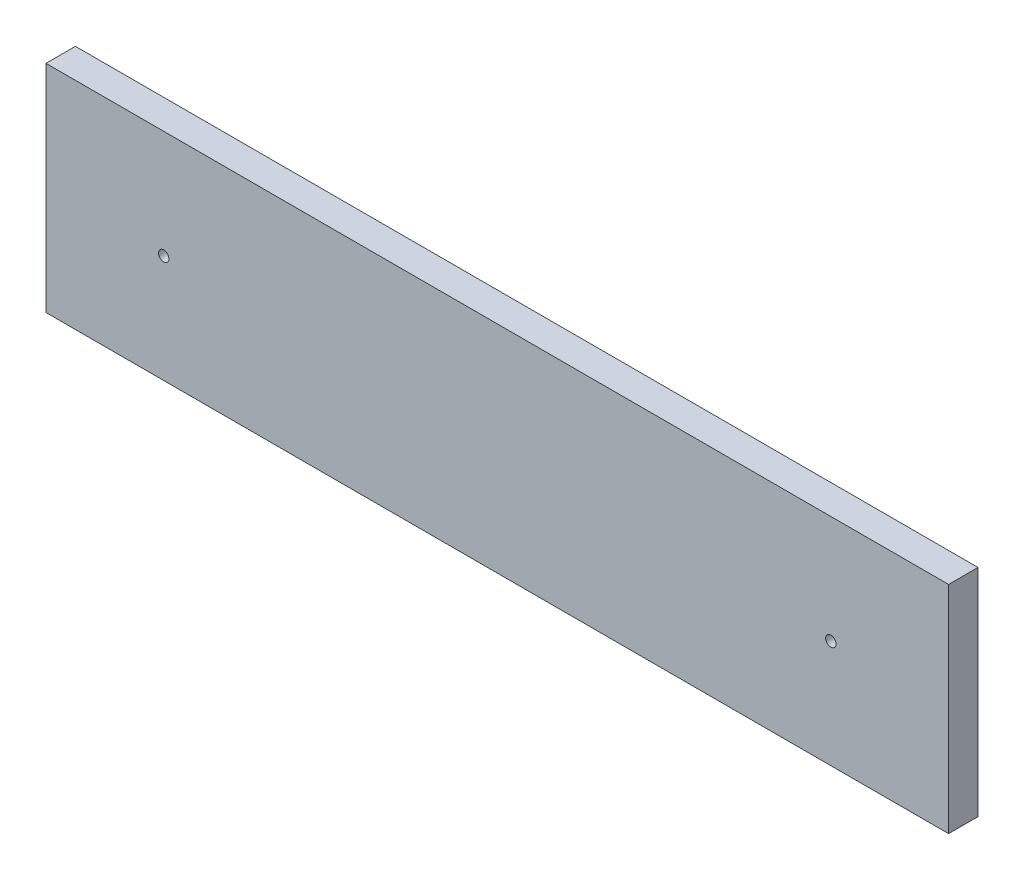
ISO-10303-21;
HEADER;
FILE_DESCRIPTION(('STEP AP214'),'2;1');
FILE_NAME('part.step','',(''),(''),'','','');
FILE_SCHEMA(('AUTOMOTIVE_DESIGN { 1 0 10303 214 1 1 1 1 }'));
ENDSEC;
DATA;
#1=APPLICATION_CONTEXT('core data for automotive mechanical design processes');
#2=APPLICATION_PROTOCOL_DEFINITION('international standard','automotive_design',2000,#1);
#3=PRODUCT_CONTEXT('',#1,'mechanical');
#4=PRODUCT('Part','Part','',(#3));
#5=PRODUCT_RELATED_PRODUCT_CATEGORY('part','',(#4));
#6=PRODUCT_DEFINITION_FORMATION('','',#4);
#7=PRODUCT_DEFINITION_CONTEXT('part definition',#1,'design');
#8=PRODUCT_DEFINITION('design','',#6,#7);
#9=PRODUCT_DEFINITION_SHAPE('','',#8);
#10=(LENGTH_UNIT() NAMED_UNIT(*) SI_UNIT(.MILLI.,.METRE.));
#11=(NAMED_UNIT(*) PLANE_ANGLE_UNIT() SI_UNIT($,.RADIAN.));
#12=(NAMED_UNIT(*) SI_UNIT($,.STERADIAN.) SOLID_ANGLE_UNIT());
#13=UNCERTAINTY_MEASURE_WITH_UNIT(LENGTH_MEASURE(1.E-05),#10,'distance_accuracy_value','');
#14=(GEOMETRIC_REPRESENTATION_CONTEXT(3) GLOBAL_UNCERTAINTY_ASSIGNED_CONTEXT((#13)) GLOBAL_UNIT_ASSIGNED_CONTEXT((#10,
#11,#12)) REPRESENTATION_CONTEXT('',''));
#15=CARTESIAN_POINT('',(0.,0.,0.));
#16=DIRECTION('',(0.,0.,1.));
#17=DIRECTION('',(1.,0.,0.));
#18=AXIS2_PLACEMENT_3D('',#15,#16,#17);
#19=CARTESIAN_POINT('',(0.,139.7,0.));
#20=DIRECTION('',(0.,0.,1.));
#21=DIRECTION('',(1.,0.,0.));
#22=AXIS2_PLACEMENT_3D('',#19,#20,#21);
#23=PLANE('',#22);
#24=CARTESIAN_POINT('',(508.,69.85,0.));
#25=DIRECTION('',(0.,0.,1.));
#26=DIRECTION('',(1.,0.,0.));
#27=AXIS2_PLACEMENT_3D('',#24,#25,#26);
#28=CIRCLE('',#27,3.3655);
#29=CARTESIAN_POINT('',(511.3655,69.85,0.));
#30=VERTEX_POINT('',#29);
#31=EDGE_CURVE('E82',#30,#30,#28,.F.);
#32=ORIENTED_EDGE('',*,*,#31,.T.);
#33=EDGE_LOOP('',(#32));
#34=FACE_BOUND('',#33,.T.);
#35=CARTESIAN_POINT('',(76.2,69.85,0.));
#36=DIRECTION('',(0.,0.,1.));
#37=DIRECTION('',(1.,0.,0.));
#38=AXIS2_PLACEMENT_3D('',#35,#36,#37);
#39=CIRCLE('',#38,3.3655);
#40=CARTESIAN_POINT('',(79.5655,69.85,0.));
#41=VERTEX_POINT('',#40);
#42=EDGE_CURVE('E19',#41,#41,#39,.F.);
#43=ORIENTED_EDGE('',*,*,#42,.T.);
#44=EDGE_LOOP('',(#43));
#45=FACE_BOUND('',#44,.T.);
#46=DIRECTION('',(1.,0.,0.));
#47=VECTOR('',#46,1.);
#48=CARTESIAN_POINT('',(0.,139.7,0.));
#49=LINE('',#48,#47);
#50=CARTESIAN_POINT('',(0.,139.7,0.));
#51=VERTEX_POINT('',#50);
#52=CARTESIAN_POINT('',(584.2,139.7,0.));
#53=VERTEX_POINT('',#52);
#54=EDGE_CURVE('E59',#51,#53,#49,.T.);
#55=ORIENTED_EDGE('',*,*,#54,.F.);
#56=DIRECTION('',(0.,1.,0.));
#57=VECTOR('',#56,1.);
#58=CARTESIAN_POINT('',(0.,0.,0.));
#59=LINE('',#58,#57);
#60=CARTESIAN_POINT('',(0.,0.,0.));
#61=VERTEX_POINT('',#60);
#62=EDGE_CURVE('E89',#51,#61,#59,.F.);
#63=ORIENTED_EDGE('',*,*,#62,.T.);
#64=DIRECTION('',(1.,0.,0.));
#65=VECTOR('',#64,1.);
#66=CARTESIAN_POINT('',(0.,0.,0.));
#67=LINE('',#66,#65);
#68=CARTESIAN_POINT('',(584.2,0.,0.));
#69=VERTEX_POINT('',#68);
#70=EDGE_CURVE('E69',#69,#61,#67,.F.);
#71=ORIENTED_EDGE('',*,*,#70,.F.);
#72=DIRECTION('',(0.,1.,0.));
#73=VECTOR('',#72,1.);
#74=CARTESIAN_POINT('',(584.2,0.,0.));
#75=LINE('',#74,#73);
#76=EDGE_CURVE('E54',#53,#69,#75,.F.);
#77=ORIENTED_EDGE('',*,*,#76,.F.);
#78=EDGE_LOOP('',(#55,#63,#71,#77));
#79=FACE_BOUND('',#78,.T.);
#80=ADVANCED_FACE('F16',(#34,#45,#79),#23,.T.);
#81=CARTESIAN_POINT('',(0.,139.7,-19.05));
#82=DIRECTION('',(0.,1.,0.));
#83=DIRECTION('',(0.,0.,1.));
#84=AXIS2_PLACEMENT_3D('',#81,#82,#83);
#85=PLANE('',#84);
#86=DIRECTION('',(-1.,0.,0.));
#87=VECTOR('',#86,1.);
#88=CARTESIAN_POINT('',(0.,139.7,-19.05));
#89=LINE('',#88,#87);
#90=CARTESIAN_POINT('',(0.,139.7,-19.05));
#91=VERTEX_POINT('',#90);
#92=CARTESIAN_POINT('',(584.2,139.7,-19.05));
#93=VERTEX_POINT('',#92);
#94=EDGE_CURVE('E84',#91,#93,#89,.F.);
#95=ORIENTED_EDGE('',*,*,#94,.F.);
#96=DIRECTION('',(0.,0.,-1.));
#97=VECTOR('',#96,1.);
#98=CARTESIAN_POINT('',(0.,139.7,0.));
#99=LINE('',#98,#97);
#100=EDGE_CURVE('E64',#91,#51,#99,.F.);
#101=ORIENTED_EDGE('',*,*,#100,.T.);
#102=ORIENTED_EDGE('',*,*,#54,.T.);
#103=DIRECTION('',(0.,0.,-1.));
#104=VECTOR('',#103,1.);
#105=CARTESIAN_POINT('',(584.2,139.7,0.));
#106=LINE('',#105,#104);
#107=EDGE_CURVE('E61',#93,#53,#106,.F.);
#108=ORIENTED_EDGE('',*,*,#107,.F.);
#109=EDGE_LOOP('',(#95,#101,#102,#108));
#110=FACE_BOUND('',#109,.T.);
#111=ADVANCED_FACE('F60',(#110),#85,.T.);
#112=CARTESIAN_POINT('',(584.2,0.,0.));
#113=DIRECTION('',(1.,0.,0.));
#114=DIRECTION('',(0.,0.,-1.));
#115=AXIS2_PLACEMENT_3D('',#112,#113,#114);
#116=PLANE('',#115);
#117=ORIENTED_EDGE('',*,*,#76,.T.);
#118=DIRECTION('',(0.,0.,-1.));
#119=VECTOR('',#118,1.);
#120=CARTESIAN_POINT('',(584.2,0.,0.));
#121=LINE('',#120,#119);
#122=CARTESIAN_POINT('',(584.2,0.,-19.05));
#123=VERTEX_POINT('',#122);
#124=EDGE_CURVE('E71',#123,#69,#121,.F.);
#125=ORIENTED_EDGE('',*,*,#124,.F.);
#126=DIRECTION('',(0.,1.,0.));
#127=VECTOR('',#126,1.);
#128=CARTESIAN_POINT('',(584.2,0.,-19.05));
#129=LINE('',#128,#127);
#130=EDGE_CURVE('E75',#93,#123,#129,.F.);
#131=ORIENTED_EDGE('',*,*,#130,.F.);
#132=ORIENTED_EDGE('',*,*,#107,.T.);
#133=EDGE_LOOP('',(#117,#125,#131,#132));
#134=FACE_BOUND('',#133,.T.);
#135=ADVANCED_FACE('F73',(#134),#116,.T.);
#136=CARTESIAN_POINT('',(0.,0.,0.));
#137=DIRECTION('',(0.,-1.,0.));
#138=DIRECTION('',(0.,0.,-1.));
#139=AXIS2_PLACEMENT_3D('',#136,#137,#138);
#140=PLANE('',#139);
#141=ORIENTED_EDGE('',*,*,#70,.T.);
#142=DIRECTION('',(0.,0.,-1.));
#143=VECTOR('',#142,1.);
#144=CARTESIAN_POINT('',(0.,0.,0.));
#145=LINE('',#144,#143);
#146=CARTESIAN_POINT('',(0.,0.,-19.05));
#147=VERTEX_POINT('',#146);
#148=EDGE_CURVE('E34',#61,#147,#145,.T.);
#149=ORIENTED_EDGE('',*,*,#148,.T.);
#150=DIRECTION('',(-1.,0.,0.));
#151=VECTOR('',#150,1.);
#152=CARTESIAN_POINT('',(0.,0.,-19.05));
#153=LINE('',#152,#151);
#154=EDGE_CURVE('E99',#123,#147,#153,.T.);
#155=ORIENTED_EDGE('',*,*,#154,.F.);
#156=ORIENTED_EDGE('',*,*,#124,.T.);
#157=EDGE_LOOP('',(#141,#149,#155,#156));
#158=FACE_BOUND('',#157,.T.);
#159=ADVANCED_FACE('F97',(#158),#140,.T.);
#160=CARTESIAN_POINT('',(0.,0.,0.));
#161=DIRECTION('',(1.,0.,0.));
#162=DIRECTION('',(0.,0.,-1.));
#163=AXIS2_PLACEMENT_3D('',#160,#161,#162);
#164=PLANE('',#163);
#165=ORIENTED_EDGE('',*,*,#100,.F.);
#166=DIRECTION('',(0.,1.,0.));
#167=VECTOR('',#166,1.);
#168=CARTESIAN_POINT('',(0.,0.,-19.05));
#169=LINE('',#168,#167);
#170=EDGE_CURVE('E81',#147,#91,#169,.T.);
#171=ORIENTED_EDGE('',*,*,#170,.F.);
#172=ORIENTED_EDGE('',*,*,#148,.F.);
#173=ORIENTED_EDGE('',*,*,#62,.F.);
#174=EDGE_LOOP('',(#165,#171,#172,#173));
#175=FACE_BOUND('',#174,.T.);
#176=ADVANCED_FACE('F106',(#175),#164,.F.);
#177=CARTESIAN_POINT('',(76.2,69.85,0.));
#178=DIRECTION('',(0.,0.,1.));
#179=DIRECTION('',(1.,0.,0.));
#180=AXIS2_PLACEMENT_3D('',#177,#178,#179);
#181=CYLINDRICAL_SURFACE('',#180,3.3655);
#182=ORIENTED_EDGE('',*,*,#42,.F.);
#183=EDGE_LOOP('',(#182));
#184=FACE_BOUND('',#183,.T.);
#185=CARTESIAN_POINT('',(76.2,69.85,-19.05));
#186=DIRECTION('',(0.,0.,1.));
#187=DIRECTION('',(1.,0.,0.));
#188=AXIS2_PLACEMENT_3D('',#185,#186,#187);
#189=CIRCLE('',#188,3.3655);
#190=CARTESIAN_POINT('',(79.5655,69.85,-19.05));
#191=VERTEX_POINT('',#190);
#192=EDGE_CURVE('E25',#191,#191,#189,.T.);
#193=ORIENTED_EDGE('',*,*,#192,.F.);
#194=EDGE_LOOP('',(#193));
#195=FACE_BOUND('',#194,.T.);
#196=ADVANCED_FACE('F108',(#184,#195),#181,.F.);
#197=CARTESIAN_POINT('',(508.,69.85,0.));
#198=DIRECTION('',(0.,0.,1.));
#199=DIRECTION('',(1.,0.,0.));
#200=AXIS2_PLACEMENT_3D('',#197,#198,#199);
#201=CYLINDRICAL_SURFACE('',#200,3.3655);
#202=ORIENTED_EDGE('',*,*,#31,.F.);
#203=EDGE_LOOP('',(#202));
#204=FACE_BOUND('',#203,.T.);
#205=CARTESIAN_POINT('',(508.,69.85,-19.05));
#206=DIRECTION('',(0.,0.,1.));
#207=DIRECTION('',(1.,0.,0.));
#208=AXIS2_PLACEMENT_3D('',#205,#206,#207);
#209=CIRCLE('',#208,3.3655);
#210=CARTESIAN_POINT('',(511.3655,69.85,-19.05));
#211=VERTEX_POINT('',#210);
#212=EDGE_CURVE('E11',#211,#211,#209,.T.);
#213=ORIENTED_EDGE('',*,*,#212,.F.);
#214=EDGE_LOOP('',(#213));
#215=FACE_BOUND('',#214,.T.);
#216=ADVANCED_FACE('F115',(#204,#215),#201,.F.);
#217=CARTESIAN_POINT('',(0.,0.,-19.05));
#218=DIRECTION('',(0.,0.,-1.));
#219=DIRECTION('',(-1.,0.,0.));
#220=AXIS2_PLACEMENT_3D('',#217,#218,#219);
#221=PLANE('',#220);
#222=ORIENTED_EDGE('',*,*,#212,.T.);
#223=EDGE_LOOP('',(#222));
#224=FACE_BOUND('',#223,.T.);
#225=ORIENTED_EDGE('',*,*,#192,.T.);
#226=EDGE_LOOP('',(#225));
#227=FACE_BOUND('',#226,.T.);
#228=ORIENTED_EDGE('',*,*,#154,.T.);
#229=ORIENTED_EDGE('',*,*,#170,.T.);
#230=ORIENTED_EDGE('',*,*,#94,.T.);
#231=ORIENTED_EDGE('',*,*,#130,.T.);
#232=EDGE_LOOP('',(#228,#229,#230,#231));
#233=FACE_BOUND('',#232,.T.);
#234=ADVANCED_FACE('F103',(#224,#227,#233),#221,.T.);
#235=CLOSED_SHELL('',(#80,#111,#135,#159,#176,#196,#216,#234));
#236=MANIFOLD_SOLID_BREP('B1',#235);
#237=ADVANCED_BREP_SHAPE_REPRESENTATION('',(#18,#236),#14);
#238=SHAPE_DEFINITION_REPRESENTATION(#9,#237);
ENDSEC;
END-ISO-10303-21;
